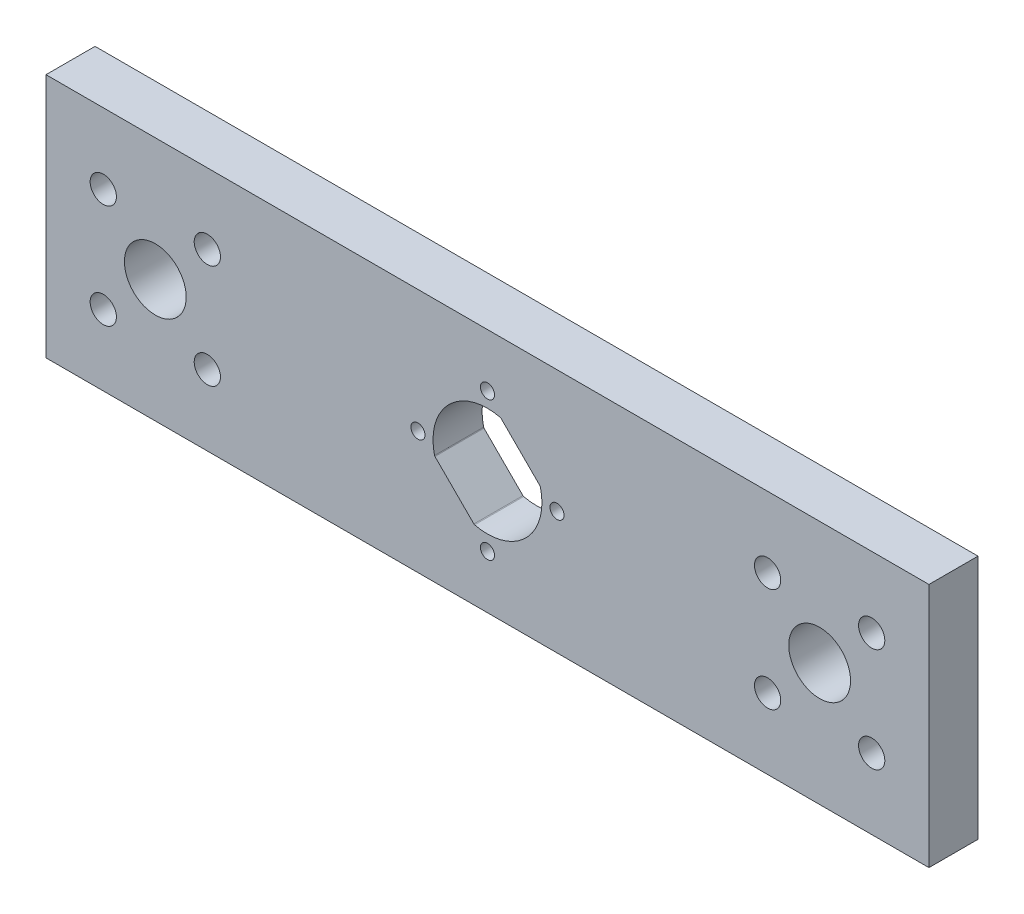
ISO-10303-21;
HEADER;
FILE_DESCRIPTION(('STEP AP214'),'2;1');
FILE_NAME('part.step','',(''),(''),'','','');
FILE_SCHEMA(('AUTOMOTIVE_DESIGN { 1 0 10303 214 1 1 1 1 }'));
ENDSEC;
DATA;
#1=APPLICATION_CONTEXT('core data for automotive mechanical design processes');
#2=APPLICATION_PROTOCOL_DEFINITION('international standard','automotive_design',2000,#1);
#3=PRODUCT_CONTEXT('',#1,'mechanical');
#4=PRODUCT('Part','Part','',(#3));
#5=PRODUCT_RELATED_PRODUCT_CATEGORY('part','',(#4));
#6=PRODUCT_DEFINITION_FORMATION('','',#4);
#7=PRODUCT_DEFINITION_CONTEXT('part definition',#1,'design');
#8=PRODUCT_DEFINITION('design','',#6,#7);
#9=PRODUCT_DEFINITION_SHAPE('','',#8);
#10=(LENGTH_UNIT() NAMED_UNIT(*) SI_UNIT(.MILLI.,.METRE.));
#11=(NAMED_UNIT(*) PLANE_ANGLE_UNIT() SI_UNIT($,.RADIAN.));
#12=(NAMED_UNIT(*) SI_UNIT($,.STERADIAN.) SOLID_ANGLE_UNIT());
#13=UNCERTAINTY_MEASURE_WITH_UNIT(LENGTH_MEASURE(1.E-05),#10,'distance_accuracy_value','');
#14=(GEOMETRIC_REPRESENTATION_CONTEXT(3) GLOBAL_UNCERTAINTY_ASSIGNED_CONTEXT((#13)) GLOBAL_UNIT_ASSIGNED_CONTEXT((#10,
#11,#12)) REPRESENTATION_CONTEXT('',''));
#15=CARTESIAN_POINT('',(0.,0.,0.));
#16=DIRECTION('',(0.,0.,1.));
#17=DIRECTION('',(1.,0.,0.));
#18=AXIS2_PLACEMENT_3D('',#15,#16,#17);
#19=CARTESIAN_POINT('',(0.,0.,6.35));
#20=DIRECTION('',(0.,0.,1.));
#21=DIRECTION('',(1.,0.,0.));
#22=AXIS2_PLACEMENT_3D('',#19,#20,#21);
#23=PLANE('',#22);
#24=CARTESIAN_POINT('',(36.2648080151982,6.73519209080189,6.35));
#25=DIRECTION('',(0.,0.,1.));
#26=DIRECTION('',(-1.,0.,0.));
#27=AXIS2_PLACEMENT_3D('',#24,#25,#26);
#28=CIRCLE('',#27,1.7);
#29=CARTESIAN_POINT('',(34.5648080151982,6.73519209080189,6.35));
#30=VERTEX_POINT('',#29);
#31=EDGE_CURVE('E393',#30,#30,#28,.T.);
#32=ORIENTED_EDGE('',*,*,#31,.F.);
#33=EDGE_LOOP('',(#32));
#34=FACE_BOUND('',#33,.T.);
#35=CARTESIAN_POINT('',(49.7351921968018,-6.73519209080188,6.35));
#36=DIRECTION('',(0.,0.,1.));
#37=DIRECTION('',(-1.,0.,0.));
#38=AXIS2_PLACEMENT_3D('',#35,#36,#37);
#39=CIRCLE('',#38,1.7);
#40=CARTESIAN_POINT('',(48.0351921968018,-6.73519209080188,6.35));
#41=VERTEX_POINT('',#40);
#42=EDGE_CURVE('E405',#41,#41,#39,.T.);
#43=ORIENTED_EDGE('',*,*,#42,.F.);
#44=EDGE_LOOP('',(#43));
#45=FACE_BOUND('',#44,.T.);
#46=CARTESIAN_POINT('',(9.00000013410969,-7.63278329429795E-13,6.35));
#47=DIRECTION('',(0.,0.,1.));
#48=DIRECTION('',(1.,0.,0.));
#49=AXIS2_PLACEMENT_3D('',#46,#47,#48);
#50=CIRCLE('',#49,0.911500000000001);
#51=CARTESIAN_POINT('',(9.9115001341097,-7.63278329429795E-13,6.35));
#52=VERTEX_POINT('',#51);
#53=EDGE_CURVE('E417',#52,#52,#50,.T.);
#54=ORIENTED_EDGE('',*,*,#53,.F.);
#55=EDGE_LOOP('',(#54));
#56=FACE_BOUND('',#55,.T.);
#57=CARTESIAN_POINT('',(-9.0000001341112,-7.63278329429795E-13,6.35));
#58=DIRECTION('',(0.,0.,1.));
#59=DIRECTION('',(1.,0.,0.));
#60=AXIS2_PLACEMENT_3D('',#57,#58,#59);
#61=CIRCLE('',#60,0.911499999999999);
#62=CARTESIAN_POINT('',(-8.08850013411121,-7.63278329429795E-13,6.35));
#63=VERTEX_POINT('',#62);
#64=EDGE_CURVE('E429',#63,#63,#61,.T.);
#65=ORIENTED_EDGE('',*,*,#64,.F.);
#66=EDGE_LOOP('',(#65));
#67=FACE_BOUND('',#66,.T.);
#68=CARTESIAN_POINT('',(-36.2648080151982,-6.7351920908019,6.35));
#69=DIRECTION('',(0.,0.,1.));
#70=DIRECTION('',(-1.,0.,0.));
#71=AXIS2_PLACEMENT_3D('',#68,#69,#70);
#72=CIRCLE('',#71,1.7);
#73=CARTESIAN_POINT('',(-37.9648080151982,-6.7351920908019,6.35));
#74=VERTEX_POINT('',#73);
#75=EDGE_CURVE('E167',#74,#74,#72,.T.);
#76=ORIENTED_EDGE('',*,*,#75,.F.);
#77=EDGE_LOOP('',(#76));
#78=FACE_BOUND('',#77,.T.);
#79=CARTESIAN_POINT('',(-36.2648080151982,6.7351920908019,6.35));
#80=DIRECTION('',(0.,0.,1.));
#81=DIRECTION('',(1.,0.,0.));
#82=AXIS2_PLACEMENT_3D('',#79,#80,#81);
#83=CIRCLE('',#82,1.7);
#84=CARTESIAN_POINT('',(-34.5648080151982,6.7351920908019,6.35));
#85=VERTEX_POINT('',#84);
#86=EDGE_CURVE('E203',#85,#85,#83,.T.);
#87=ORIENTED_EDGE('',*,*,#86,.F.);
#88=EDGE_LOOP('',(#87));
#89=FACE_BOUND('',#88,.T.);
#90=CARTESIAN_POINT('',(-43.000000106,0.,6.35));
#91=DIRECTION('',(0.,0.,1.));
#92=DIRECTION('',(1.,0.,0.));
#93=AXIS2_PLACEMENT_3D('',#90,#91,#92);
#94=CIRCLE('',#93,4.00000000000001);
#95=CARTESIAN_POINT('',(-39.000000106,0.,6.35));
#96=VERTEX_POINT('',#95);
#97=EDGE_CURVE('E215',#96,#96,#94,.T.);
#98=ORIENTED_EDGE('',*,*,#97,.F.);
#99=EDGE_LOOP('',(#98));
#100=FACE_BOUND('',#99,.T.);
#101=DIRECTION('',(0.,1.,0.));
#102=VECTOR('',#101,1.);
#103=CARTESIAN_POINT('',(57.15,15.875,6.35));
#104=LINE('',#103,#102);
#105=CARTESIAN_POINT('',(57.15,-15.875,6.35));
#106=VERTEX_POINT('',#105);
#107=CARTESIAN_POINT('',(57.15,15.875,6.35));
#108=VERTEX_POINT('',#107);
#109=EDGE_CURVE('E221',#106,#108,#104,.T.);
#110=ORIENTED_EDGE('',*,*,#109,.T.);
#111=DIRECTION('',(-1.,0.,0.));
#112=VECTOR('',#111,1.);
#113=CARTESIAN_POINT('',(-57.15,15.875,6.35));
#114=LINE('',#113,#112);
#115=CARTESIAN_POINT('',(-57.15,15.875,6.35));
#116=VERTEX_POINT('',#115);
#117=EDGE_CURVE('E224',#108,#116,#114,.T.);
#118=ORIENTED_EDGE('',*,*,#117,.T.);
#119=DIRECTION('',(0.,-1.,0.));
#120=VECTOR('',#119,1.);
#121=CARTESIAN_POINT('',(-57.15,15.875,6.35));
#122=LINE('',#121,#120);
#123=CARTESIAN_POINT('',(-57.15,-15.875,6.35));
#124=VERTEX_POINT('',#123);
#125=EDGE_CURVE('E227',#116,#124,#122,.T.);
#126=ORIENTED_EDGE('',*,*,#125,.T.);
#127=DIRECTION('',(1.,0.,0.));
#128=VECTOR('',#127,1.);
#129=CARTESIAN_POINT('',(-57.15,-15.875,6.35));
#130=LINE('',#129,#128);
#131=EDGE_CURVE('E229',#124,#106,#130,.T.);
#132=ORIENTED_EDGE('',*,*,#131,.T.);
#133=EDGE_LOOP('',(#110,#118,#126,#132));
#134=FACE_BOUND('',#133,.T.);
#135=CARTESIAN_POINT('',(43.000000106,0.,6.35));
#136=DIRECTION('',(0.,0.,1.));
#137=DIRECTION('',(1.,0.,0.));
#138=AXIS2_PLACEMENT_3D('',#135,#136,#137);
#139=CIRCLE('',#138,4.);
#140=CARTESIAN_POINT('',(47.000000106,0.,6.35));
#141=VERTEX_POINT('',#140);
#142=EDGE_CURVE('E209',#141,#141,#139,.T.);
#143=ORIENTED_EDGE('',*,*,#142,.F.);
#144=EDGE_LOOP('',(#143));
#145=FACE_BOUND('',#144,.T.);
#146=CARTESIAN_POINT('',(-49.7351921968018,6.73519209080188,6.35));
#147=DIRECTION('',(0.,0.,1.));
#148=DIRECTION('',(-1.,0.,0.));
#149=AXIS2_PLACEMENT_3D('',#146,#147,#148);
#150=CIRCLE('',#149,1.7);
#151=CARTESIAN_POINT('',(-51.4351921968018,6.73519209080188,6.35));
#152=VERTEX_POINT('',#151);
#153=EDGE_CURVE('E197',#152,#152,#150,.T.);
#154=ORIENTED_EDGE('',*,*,#153,.F.);
#155=EDGE_LOOP('',(#154));
#156=FACE_BOUND('',#155,.T.);
#157=CARTESIAN_POINT('',(-7.52869988573934E-13,-7.63278329429795E-13,6.35));
#158=DIRECTION('',(0.,0.,1.));
#159=DIRECTION('',(1.,0.,0.));
#160=AXIS2_PLACEMENT_3D('',#157,#158,#159);
#161=CIRCLE('',#160,7.05);
#162=CARTESIAN_POINT('',(1.66385561397105,6.85084553145406,6.35));
#163=VERTEX_POINT('',#162);
#164=CARTESIAN_POINT('',(-6.85084553145558,-1.66385561397257,6.35));
#165=VERTEX_POINT('',#164);
#166=EDGE_CURVE('E137',#163,#165,#161,.T.);
#167=ORIENTED_EDGE('',*,*,#166,.F.);
#168=CARTESIAN_POINT('',(1.61665403626972,6.65649530361136,6.35));
#169=DIRECTION('',(0.,0.,1.));
#170=DIRECTION('',(1.,0.,0.));
#171=AXIS2_PLACEMENT_3D('',#168,#169,#170);
#172=CIRCLE('',#171,0.200000000000001);
#173=CARTESIAN_POINT('',(1.75807539250702,6.79791665984868,6.35));
#174=VERTEX_POINT('',#173);
#175=EDGE_CURVE('E129',#174,#163,#172,.T.);
#176=ORIENTED_EDGE('',*,*,#175,.F.);
#177=DIRECTION('',(-0.707106781186547,0.707106781186547,0.));
#178=VECTOR('',#177,1.);
#179=CARTESIAN_POINT('',(6.79791665984869,1.75807539250701,6.35));
#180=LINE('',#179,#178);
#181=CARTESIAN_POINT('',(6.79791665984868,1.75807539250701,6.35));
#182=VERTEX_POINT('',#181);
#183=EDGE_CURVE('E164',#182,#174,#180,.T.);
#184=ORIENTED_EDGE('',*,*,#183,.F.);
#185=CARTESIAN_POINT('',(6.65649530361138,1.6166540362697,6.35));
#186=DIRECTION('',(0.,0.,1.));
#187=DIRECTION('',(1.,0.,0.));
#188=AXIS2_PLACEMENT_3D('',#185,#186,#187);
#189=CIRCLE('',#188,0.200000000000004);
#190=CARTESIAN_POINT('',(6.85084553145407,1.66385561397104,6.35));
#191=VERTEX_POINT('',#190);
#192=EDGE_CURVE('E162',#191,#182,#189,.T.);
#193=ORIENTED_EDGE('',*,*,#192,.F.);
#194=CARTESIAN_POINT('',(-7.52869988573934E-13,-7.63278329429795E-13,6.35));
#195=DIRECTION('',(0.,0.,1.));
#196=DIRECTION('',(1.,0.,0.));
#197=AXIS2_PLACEMENT_3D('',#194,#195,#196);
#198=CIRCLE('',#197,7.05);
#199=CARTESIAN_POINT('',(-1.66385561397255,-6.85084553145559,6.35));
#200=VERTEX_POINT('',#199);
#201=EDGE_CURVE('E160',#200,#191,#198,.T.);
#202=ORIENTED_EDGE('',*,*,#201,.F.);
#203=CARTESIAN_POINT('',(-1.61665403627122,-6.65649530361289,6.35));
#204=DIRECTION('',(0.,0.,1.));
#205=DIRECTION('',(1.,0.,0.));
#206=AXIS2_PLACEMENT_3D('',#203,#204,#205);
#207=CIRCLE('',#206,0.200000000000011);
#208=CARTESIAN_POINT('',(-1.75807539250853,-6.79791665985022,6.35));
#209=VERTEX_POINT('',#208);
#210=EDGE_CURVE('E158',#209,#200,#207,.T.);
#211=ORIENTED_EDGE('',*,*,#210,.F.);
#212=DIRECTION('',(0.707106781186548,-0.707106781186548,0.));
#213=VECTOR('',#212,1.);
#214=CARTESIAN_POINT('',(-6.7979166598502,-1.75807539250855,6.35));
#215=LINE('',#214,#213);
#216=CARTESIAN_POINT('',(-6.7979166598502,-1.75807539250855,6.35));
#217=VERTEX_POINT('',#216);
#218=EDGE_CURVE('E153',#217,#209,#215,.T.);
#219=ORIENTED_EDGE('',*,*,#218,.F.);
#220=CARTESIAN_POINT('',(-6.65649530361288,-1.61665403627124,6.35));
#221=DIRECTION('',(0.,0.,1.));
#222=DIRECTION('',(1.,0.,0.));
#223=AXIS2_PLACEMENT_3D('',#220,#221,#222);
#224=CIRCLE('',#223,0.2);
#225=EDGE_CURVE('E151',#165,#217,#224,.T.);
#226=ORIENTED_EDGE('',*,*,#225,.F.);
#227=EDGE_LOOP('',(#167,#176,#184,#193,#202,#211,#219,#226));
#228=FACE_BOUND('',#227,.T.);
#229=CARTESIAN_POINT('',(-49.7351921968018,-6.73519209080188,6.35));
#230=DIRECTION('',(0.,0.,1.));
#231=DIRECTION('',(1.,0.,0.));
#232=AXIS2_PLACEMENT_3D('',#229,#230,#231);
#233=CIRCLE('',#232,1.7);
#234=CARTESIAN_POINT('',(-48.0351921968018,-6.73519209080188,6.35));
#235=VERTEX_POINT('',#234);
#236=EDGE_CURVE('E435',#235,#235,#233,.T.);
#237=ORIENTED_EDGE('',*,*,#236,.F.);
#238=EDGE_LOOP('',(#237));
#239=FACE_BOUND('',#238,.T.);
#240=CARTESIAN_POINT('',(-7.50665624302622E-13,-9.00000013411121,6.35));
#241=DIRECTION('',(0.,0.,1.));
#242=DIRECTION('',(1.,0.,0.));
#243=AXIS2_PLACEMENT_3D('',#240,#241,#242);
#244=CIRCLE('',#243,0.911499999999998);
#245=CARTESIAN_POINT('',(0.911499999999248,-9.00000013411121,6.35));
#246=VERTEX_POINT('',#245);
#247=EDGE_CURVE('E423',#246,#246,#244,.T.);
#248=ORIENTED_EDGE('',*,*,#247,.F.);
#249=EDGE_LOOP('',(#248));
#250=FACE_BOUND('',#249,.T.);
#251=CARTESIAN_POINT('',(-7.52869988573934E-13,9.00000013410969,6.35));
#252=DIRECTION('',(0.,0.,1.));
#253=DIRECTION('',(1.,0.,0.));
#254=AXIS2_PLACEMENT_3D('',#251,#252,#253);
#255=CIRCLE('',#254,0.911499999999998);
#256=CARTESIAN_POINT('',(0.911499999999245,9.00000013410969,6.35));
#257=VERTEX_POINT('',#256);
#258=EDGE_CURVE('E411',#257,#257,#255,.T.);
#259=ORIENTED_EDGE('',*,*,#258,.F.);
#260=EDGE_LOOP('',(#259));
#261=FACE_BOUND('',#260,.T.);
#262=CARTESIAN_POINT('',(36.2648080151982,-6.73519209080189,6.35));
#263=DIRECTION('',(0.,0.,1.));
#264=DIRECTION('',(1.,0.,0.));
#265=AXIS2_PLACEMENT_3D('',#262,#263,#264);
#266=CIRCLE('',#265,1.7);
#267=CARTESIAN_POINT('',(37.9648080151982,-6.73519209080189,6.35));
#268=VERTEX_POINT('',#267);
#269=EDGE_CURVE('E399',#268,#268,#266,.T.);
#270=ORIENTED_EDGE('',*,*,#269,.F.);
#271=EDGE_LOOP('',(#270));
#272=FACE_BOUND('',#271,.T.);
#273=CARTESIAN_POINT('',(49.7351921968018,6.73519209080189,6.35));
#274=DIRECTION('',(0.,0.,1.));
#275=DIRECTION('',(1.,0.,0.));
#276=AXIS2_PLACEMENT_3D('',#273,#274,#275);
#277=CIRCLE('',#276,1.7);
#278=CARTESIAN_POINT('',(51.4351921968018,6.73519209080189,6.35));
#279=VERTEX_POINT('',#278);
#280=EDGE_CURVE('E384',#279,#279,#277,.T.);
#281=ORIENTED_EDGE('',*,*,#280,.F.);
#282=EDGE_LOOP('',(#281));
#283=FACE_BOUND('',#282,.T.);
#284=ADVANCED_FACE('F40',(#34,#45,#56,#67,#78,#89,#100,#134,#145,#156,#228,#239,#250,#261,#272,
#283),#23,.T.);
#285=CARTESIAN_POINT('',(0.,0.,0.));
#286=DIRECTION('',(0.,0.,1.));
#287=DIRECTION('',(1.,0.,0.));
#288=AXIS2_PLACEMENT_3D('',#285,#286,#287);
#289=PLANE('',#288);
#290=CARTESIAN_POINT('',(-49.7351921968018,6.73519209080188,0.));
#291=DIRECTION('',(0.,0.,1.));
#292=DIRECTION('',(-1.,0.,0.));
#293=AXIS2_PLACEMENT_3D('',#290,#291,#292);
#294=CIRCLE('',#293,1.7);
#295=CARTESIAN_POINT('',(-51.4351921968018,6.73519209080188,0.));
#296=VERTEX_POINT('',#295);
#297=EDGE_CURVE('E145',#296,#296,#294,.T.);
#298=ORIENTED_EDGE('',*,*,#297,.T.);
#299=EDGE_LOOP('',(#298));
#300=FACE_BOUND('',#299,.T.);
#301=CARTESIAN_POINT('',(-36.2648080151982,6.7351920908019,0.));
#302=DIRECTION('',(0.,0.,1.));
#303=DIRECTION('',(1.,0.,0.));
#304=AXIS2_PLACEMENT_3D('',#301,#302,#303);
#305=CIRCLE('',#304,1.7);
#306=CARTESIAN_POINT('',(-34.5648080151982,6.7351920908019,0.));
#307=VERTEX_POINT('',#306);
#308=EDGE_CURVE('E200',#307,#307,#305,.T.);
#309=ORIENTED_EDGE('',*,*,#308,.T.);
#310=EDGE_LOOP('',(#309));
#311=FACE_BOUND('',#310,.T.);
#312=CARTESIAN_POINT('',(43.000000106,0.,0.));
#313=DIRECTION('',(0.,0.,1.));
#314=DIRECTION('',(1.,0.,0.));
#315=AXIS2_PLACEMENT_3D('',#312,#313,#314);
#316=CIRCLE('',#315,4.);
#317=CARTESIAN_POINT('',(47.000000106,0.,0.));
#318=VERTEX_POINT('',#317);
#319=EDGE_CURVE('E206',#318,#318,#316,.T.);
#320=ORIENTED_EDGE('',*,*,#319,.T.);
#321=EDGE_LOOP('',(#320));
#322=FACE_BOUND('',#321,.T.);
#323=CARTESIAN_POINT('',(-43.000000106,0.,0.));
#324=DIRECTION('',(0.,0.,1.));
#325=DIRECTION('',(1.,0.,0.));
#326=AXIS2_PLACEMENT_3D('',#323,#324,#325);
#327=CIRCLE('',#326,4.00000000000001);
#328=CARTESIAN_POINT('',(-39.000000106,0.,0.));
#329=VERTEX_POINT('',#328);
#330=EDGE_CURVE('E212',#329,#329,#327,.T.);
#331=ORIENTED_EDGE('',*,*,#330,.T.);
#332=EDGE_LOOP('',(#331));
#333=FACE_BOUND('',#332,.T.);
#334=DIRECTION('',(0.,1.,0.));
#335=VECTOR('',#334,1.);
#336=CARTESIAN_POINT('',(57.15,15.875,0.));
#337=LINE('',#336,#335);
#338=CARTESIAN_POINT('',(57.15,-15.875,0.));
#339=VERTEX_POINT('',#338);
#340=CARTESIAN_POINT('',(57.15,15.875,0.));
#341=VERTEX_POINT('',#340);
#342=EDGE_CURVE('E218',#339,#341,#337,.T.);
#343=ORIENTED_EDGE('',*,*,#342,.F.);
#344=DIRECTION('',(1.,0.,0.));
#345=VECTOR('',#344,1.);
#346=CARTESIAN_POINT('',(-57.15,-15.875,0.));
#347=LINE('',#346,#345);
#348=CARTESIAN_POINT('',(-57.15,-15.875,0.));
#349=VERTEX_POINT('',#348);
#350=EDGE_CURVE('E225',#349,#339,#347,.T.);
#351=ORIENTED_EDGE('',*,*,#350,.F.);
#352=DIRECTION('',(0.,-1.,0.));
#353=VECTOR('',#352,1.);
#354=CARTESIAN_POINT('',(-57.15,15.875,0.));
#355=LINE('',#354,#353);
#356=CARTESIAN_POINT('',(-57.15,15.875,0.));
#357=VERTEX_POINT('',#356);
#358=EDGE_CURVE('E236',#357,#349,#355,.T.);
#359=ORIENTED_EDGE('',*,*,#358,.F.);
#360=DIRECTION('',(-1.,0.,0.));
#361=VECTOR('',#360,1.);
#362=CARTESIAN_POINT('',(-57.15,15.875,0.));
#363=LINE('',#362,#361);
#364=EDGE_CURVE('E234',#341,#357,#363,.T.);
#365=ORIENTED_EDGE('',*,*,#364,.F.);
#366=EDGE_LOOP('',(#343,#351,#359,#365));
#367=FACE_BOUND('',#366,.T.);
#368=CARTESIAN_POINT('',(1.61665403626972,6.65649530361136,0.));
#369=DIRECTION('',(0.,0.,1.));
#370=DIRECTION('',(1.,0.,0.));
#371=AXIS2_PLACEMENT_3D('',#368,#369,#370);
#372=CIRCLE('',#371,0.200000000000001);
#373=CARTESIAN_POINT('',(1.75807539250702,6.79791665984868,0.));
#374=VERTEX_POINT('',#373);
#375=CARTESIAN_POINT('',(1.66385561397105,6.85084553145406,0.));
#376=VERTEX_POINT('',#375);
#377=EDGE_CURVE('E63',#374,#376,#372,.T.);
#378=ORIENTED_EDGE('',*,*,#377,.T.);
#379=CARTESIAN_POINT('',(-7.52869988573934E-13,-7.63278329429795E-13,0.));
#380=DIRECTION('',(0.,0.,1.));
#381=DIRECTION('',(1.,0.,0.));
#382=AXIS2_PLACEMENT_3D('',#379,#380,#381);
#383=CIRCLE('',#382,7.05);
#384=CARTESIAN_POINT('',(-6.85084553145558,-1.66385561397257,0.));
#385=VERTEX_POINT('',#384);
#386=EDGE_CURVE('E144',#376,#385,#383,.T.);
#387=ORIENTED_EDGE('',*,*,#386,.T.);
#388=CARTESIAN_POINT('',(-6.65649530361288,-1.61665403627124,0.));
#389=DIRECTION('',(0.,0.,1.));
#390=DIRECTION('',(1.,0.,0.));
#391=AXIS2_PLACEMENT_3D('',#388,#389,#390);
#392=CIRCLE('',#391,0.2);
#393=CARTESIAN_POINT('',(-6.7979166598502,-1.75807539250855,0.));
#394=VERTEX_POINT('',#393);
#395=EDGE_CURVE('E169',#385,#394,#392,.T.);
#396=ORIENTED_EDGE('',*,*,#395,.T.);
#397=DIRECTION('',(0.707106781186548,-0.707106781186548,0.));
#398=VECTOR('',#397,1.);
#399=CARTESIAN_POINT('',(-6.7979166598502,-1.75807539250855,0.));
#400=LINE('',#399,#398);
#401=CARTESIAN_POINT('',(-1.75807539250853,-6.79791665985022,0.));
#402=VERTEX_POINT('',#401);
#403=EDGE_CURVE('E172',#394,#402,#400,.T.);
#404=ORIENTED_EDGE('',*,*,#403,.T.);
#405=CARTESIAN_POINT('',(-1.61665403627122,-6.65649530361289,0.));
#406=DIRECTION('',(0.,0.,1.));
#407=DIRECTION('',(1.,0.,0.));
#408=AXIS2_PLACEMENT_3D('',#405,#406,#407);
#409=CIRCLE('',#408,0.200000000000011);
#410=CARTESIAN_POINT('',(-1.66385561397255,-6.85084553145559,0.));
#411=VERTEX_POINT('',#410);
#412=EDGE_CURVE('E175',#402,#411,#409,.T.);
#413=ORIENTED_EDGE('',*,*,#412,.T.);
#414=CARTESIAN_POINT('',(-7.52869988573934E-13,-7.63278329429795E-13,0.));
#415=DIRECTION('',(0.,0.,1.));
#416=DIRECTION('',(1.,0.,0.));
#417=AXIS2_PLACEMENT_3D('',#414,#415,#416);
#418=CIRCLE('',#417,7.05);
#419=CARTESIAN_POINT('',(6.85084553145407,1.66385561397104,0.));
#420=VERTEX_POINT('',#419);
#421=EDGE_CURVE('E178',#411,#420,#418,.T.);
#422=ORIENTED_EDGE('',*,*,#421,.T.);
#423=CARTESIAN_POINT('',(6.65649530361138,1.6166540362697,0.));
#424=DIRECTION('',(0.,0.,1.));
#425=DIRECTION('',(1.,0.,0.));
#426=AXIS2_PLACEMENT_3D('',#423,#424,#425);
#427=CIRCLE('',#426,0.200000000000004);
#428=CARTESIAN_POINT('',(6.79791665984869,1.75807539250701,0.));
#429=VERTEX_POINT('',#428);
#430=EDGE_CURVE('E181',#420,#429,#427,.T.);
#431=ORIENTED_EDGE('',*,*,#430,.T.);
#432=DIRECTION('',(-0.707106781186547,0.707106781186547,0.));
#433=VECTOR('',#432,1.);
#434=CARTESIAN_POINT('',(6.79791665984869,1.75807539250701,0.));
#435=LINE('',#434,#433);
#436=EDGE_CURVE('E138',#429,#374,#435,.T.);
#437=ORIENTED_EDGE('',*,*,#436,.T.);
#438=EDGE_LOOP('',(#378,#387,#396,#404,#413,#422,#431,#437));
#439=FACE_BOUND('',#438,.T.);
#440=CARTESIAN_POINT('',(-36.2648080151982,-6.7351920908019,0.));
#441=DIRECTION('',(0.,0.,1.));
#442=DIRECTION('',(-1.,0.,0.));
#443=AXIS2_PLACEMENT_3D('',#440,#441,#442);
#444=CIRCLE('',#443,1.7);
#445=CARTESIAN_POINT('',(-37.9648080151982,-6.7351920908019,0.));
#446=VERTEX_POINT('',#445);
#447=EDGE_CURVE('E438',#446,#446,#444,.T.);
#448=ORIENTED_EDGE('',*,*,#447,.T.);
#449=EDGE_LOOP('',(#448));
#450=FACE_BOUND('',#449,.T.);
#451=CARTESIAN_POINT('',(-49.7351921968018,-6.73519209080188,0.));
#452=DIRECTION('',(0.,0.,1.));
#453=DIRECTION('',(1.,0.,0.));
#454=AXIS2_PLACEMENT_3D('',#451,#452,#453);
#455=CIRCLE('',#454,1.7);
#456=CARTESIAN_POINT('',(-48.0351921968018,-6.73519209080188,0.));
#457=VERTEX_POINT('',#456);
#458=EDGE_CURVE('E432',#457,#457,#455,.T.);
#459=ORIENTED_EDGE('',*,*,#458,.T.);
#460=EDGE_LOOP('',(#459));
#461=FACE_BOUND('',#460,.T.);
#462=CARTESIAN_POINT('',(-9.0000001341112,-7.63278329429795E-13,0.));
#463=DIRECTION('',(0.,0.,1.));
#464=DIRECTION('',(1.,0.,0.));
#465=AXIS2_PLACEMENT_3D('',#462,#463,#464);
#466=CIRCLE('',#465,0.911499999999999);
#467=CARTESIAN_POINT('',(-8.08850013411121,-7.63278329429795E-13,0.));
#468=VERTEX_POINT('',#467);
#469=EDGE_CURVE('E426',#468,#468,#466,.T.);
#470=ORIENTED_EDGE('',*,*,#469,.T.);
#471=EDGE_LOOP('',(#470));
#472=FACE_BOUND('',#471,.T.);
#473=CARTESIAN_POINT('',(-7.50665624302622E-13,-9.00000013411121,0.));
#474=DIRECTION('',(0.,0.,1.));
#475=DIRECTION('',(1.,0.,0.));
#476=AXIS2_PLACEMENT_3D('',#473,#474,#475);
#477=CIRCLE('',#476,0.911499999999998);
#478=CARTESIAN_POINT('',(0.911499999999248,-9.00000013411121,0.));
#479=VERTEX_POINT('',#478);
#480=EDGE_CURVE('E420',#479,#479,#477,.T.);
#481=ORIENTED_EDGE('',*,*,#480,.T.);
#482=EDGE_LOOP('',(#481));
#483=FACE_BOUND('',#482,.T.);
#484=CARTESIAN_POINT('',(9.00000013410969,-7.63278329429795E-13,0.));
#485=DIRECTION('',(0.,0.,1.));
#486=DIRECTION('',(1.,0.,0.));
#487=AXIS2_PLACEMENT_3D('',#484,#485,#486);
#488=CIRCLE('',#487,0.911500000000001);
#489=CARTESIAN_POINT('',(9.9115001341097,-7.63278329429795E-13,0.));
#490=VERTEX_POINT('',#489);
#491=EDGE_CURVE('E414',#490,#490,#488,.T.);
#492=ORIENTED_EDGE('',*,*,#491,.T.);
#493=EDGE_LOOP('',(#492));
#494=FACE_BOUND('',#493,.T.);
#495=CARTESIAN_POINT('',(-7.52869988573934E-13,9.00000013410969,0.));
#496=DIRECTION('',(0.,0.,1.));
#497=DIRECTION('',(1.,0.,0.));
#498=AXIS2_PLACEMENT_3D('',#495,#496,#497);
#499=CIRCLE('',#498,0.911499999999998);
#500=CARTESIAN_POINT('',(0.911499999999245,9.00000013410969,0.));
#501=VERTEX_POINT('',#500);
#502=EDGE_CURVE('E408',#501,#501,#499,.T.);
#503=ORIENTED_EDGE('',*,*,#502,.T.);
#504=EDGE_LOOP('',(#503));
#505=FACE_BOUND('',#504,.T.);
#506=CARTESIAN_POINT('',(49.7351921968018,-6.73519209080188,0.));
#507=DIRECTION('',(0.,0.,1.));
#508=DIRECTION('',(-1.,0.,0.));
#509=AXIS2_PLACEMENT_3D('',#506,#507,#508);
#510=CIRCLE('',#509,1.7);
#511=CARTESIAN_POINT('',(48.0351921968018,-6.73519209080188,0.));
#512=VERTEX_POINT('',#511);
#513=EDGE_CURVE('E402',#512,#512,#510,.T.);
#514=ORIENTED_EDGE('',*,*,#513,.T.);
#515=EDGE_LOOP('',(#514));
#516=FACE_BOUND('',#515,.T.);
#517=CARTESIAN_POINT('',(36.2648080151982,-6.73519209080189,0.));
#518=DIRECTION('',(0.,0.,1.));
#519=DIRECTION('',(1.,0.,0.));
#520=AXIS2_PLACEMENT_3D('',#517,#518,#519);
#521=CIRCLE('',#520,1.7);
#522=CARTESIAN_POINT('',(37.9648080151982,-6.73519209080189,0.));
#523=VERTEX_POINT('',#522);
#524=EDGE_CURVE('E396',#523,#523,#521,.T.);
#525=ORIENTED_EDGE('',*,*,#524,.T.);
#526=EDGE_LOOP('',(#525));
#527=FACE_BOUND('',#526,.T.);
#528=CARTESIAN_POINT('',(36.2648080151982,6.73519209080189,0.));
#529=DIRECTION('',(0.,0.,1.));
#530=DIRECTION('',(-1.,0.,0.));
#531=AXIS2_PLACEMENT_3D('',#528,#529,#530);
#532=CIRCLE('',#531,1.7);
#533=CARTESIAN_POINT('',(34.5648080151982,6.73519209080189,0.));
#534=VERTEX_POINT('',#533);
#535=EDGE_CURVE('E390',#534,#534,#532,.T.);
#536=ORIENTED_EDGE('',*,*,#535,.T.);
#537=EDGE_LOOP('',(#536));
#538=FACE_BOUND('',#537,.T.);
#539=CARTESIAN_POINT('',(49.7351921968018,6.73519209080189,0.));
#540=DIRECTION('',(0.,0.,1.));
#541=DIRECTION('',(1.,0.,0.));
#542=AXIS2_PLACEMENT_3D('',#539,#540,#541);
#543=CIRCLE('',#542,1.7);
#544=CARTESIAN_POINT('',(51.4351921968018,6.73519209080189,0.));
#545=VERTEX_POINT('',#544);
#546=EDGE_CURVE('E387',#545,#545,#543,.T.);
#547=ORIENTED_EDGE('',*,*,#546,.T.);
#548=EDGE_LOOP('',(#547));
#549=FACE_BOUND('',#548,.T.);
#550=ADVANCED_FACE('F254',(#300,#311,#322,#333,#367,#439,#450,#461,#472,#483,#494,#505,#516,
#527,#538,#549),#289,.F.);
#551=CARTESIAN_POINT('',(57.15,15.875,6.35));
#552=DIRECTION('',(-1.,0.,0.));
#553=DIRECTION('',(0.,0.,1.));
#554=AXIS2_PLACEMENT_3D('',#551,#552,#553);
#555=PLANE('',#554);
#556=ORIENTED_EDGE('',*,*,#342,.T.);
#557=DIRECTION('',(0.,0.,-1.));
#558=VECTOR('',#557,1.);
#559=CARTESIAN_POINT('',(57.15,15.875,6.35));
#560=LINE('',#559,#558);
#561=EDGE_CURVE('E11',#108,#341,#560,.T.);
#562=ORIENTED_EDGE('',*,*,#561,.F.);
#563=ORIENTED_EDGE('',*,*,#109,.F.);
#564=DIRECTION('',(0.,0.,-1.));
#565=VECTOR('',#564,1.);
#566=CARTESIAN_POINT('',(57.15,-15.875,6.35));
#567=LINE('',#566,#565);
#568=EDGE_CURVE('E231',#106,#339,#567,.T.);
#569=ORIENTED_EDGE('',*,*,#568,.T.);
#570=EDGE_LOOP('',(#556,#562,#563,#569));
#571=FACE_BOUND('',#570,.T.);
#572=ADVANCED_FACE('F42',(#571),#555,.F.);
#573=CARTESIAN_POINT('',(-57.15,15.875,6.35));
#574=DIRECTION('',(0.,-1.,0.));
#575=DIRECTION('',(0.,0.,-1.));
#576=AXIS2_PLACEMENT_3D('',#573,#574,#575);
#577=PLANE('',#576);
#578=ORIENTED_EDGE('',*,*,#364,.T.);
#579=DIRECTION('',(0.,0.,-1.));
#580=VECTOR('',#579,1.);
#581=CARTESIAN_POINT('',(-57.15,15.875,6.35));
#582=LINE('',#581,#580);
#583=EDGE_CURVE('E48',#116,#357,#582,.T.);
#584=ORIENTED_EDGE('',*,*,#583,.F.);
#585=ORIENTED_EDGE('',*,*,#117,.F.);
#586=ORIENTED_EDGE('',*,*,#561,.T.);
#587=EDGE_LOOP('',(#578,#584,#585,#586));
#588=FACE_BOUND('',#587,.T.);
#589=ADVANCED_FACE('F265',(#588),#577,.F.);
#590=CARTESIAN_POINT('',(-57.15,15.875,6.35));
#591=DIRECTION('',(1.,0.,0.));
#592=DIRECTION('',(0.,0.,-1.));
#593=AXIS2_PLACEMENT_3D('',#590,#591,#592);
#594=PLANE('',#593);
#595=ORIENTED_EDGE('',*,*,#358,.T.);
#596=DIRECTION('',(0.,0.,-1.));
#597=VECTOR('',#596,1.);
#598=CARTESIAN_POINT('',(-57.15,-15.875,6.35));
#599=LINE('',#598,#597);
#600=EDGE_CURVE('E241',#124,#349,#599,.T.);
#601=ORIENTED_EDGE('',*,*,#600,.F.);
#602=ORIENTED_EDGE('',*,*,#125,.F.);
#603=ORIENTED_EDGE('',*,*,#583,.T.);
#604=EDGE_LOOP('',(#595,#601,#602,#603));
#605=FACE_BOUND('',#604,.T.);
#606=ADVANCED_FACE('F248',(#605),#594,.F.);
#607=CARTESIAN_POINT('',(-57.15,-15.875,6.35));
#608=DIRECTION('',(0.,1.,0.));
#609=DIRECTION('',(0.,0.,1.));
#610=AXIS2_PLACEMENT_3D('',#607,#608,#609);
#611=PLANE('',#610);
#612=ORIENTED_EDGE('',*,*,#350,.T.);
#613=ORIENTED_EDGE('',*,*,#568,.F.);
#614=ORIENTED_EDGE('',*,*,#131,.F.);
#615=ORIENTED_EDGE('',*,*,#600,.T.);
#616=EDGE_LOOP('',(#612,#613,#614,#615));
#617=FACE_BOUND('',#616,.T.);
#618=ADVANCED_FACE('F258',(#617),#611,.F.);
#619=CARTESIAN_POINT('',(-43.000000106,0.,6.35));
#620=DIRECTION('',(0.,0.,-1.));
#621=DIRECTION('',(-1.,0.,0.));
#622=AXIS2_PLACEMENT_3D('',#619,#620,#621);
#623=CYLINDRICAL_SURFACE('',#622,4.00000000000001);
#624=ORIENTED_EDGE('',*,*,#97,.T.);
#625=EDGE_LOOP('',(#624));
#626=FACE_BOUND('',#625,.T.);
#627=ORIENTED_EDGE('',*,*,#330,.F.);
#628=EDGE_LOOP('',(#627));
#629=FACE_BOUND('',#628,.T.);
#630=ADVANCED_FACE('F283',(#626,#629),#623,.F.);
#631=CARTESIAN_POINT('',(43.000000106,0.,6.35));
#632=DIRECTION('',(0.,0.,-1.));
#633=DIRECTION('',(-1.,0.,0.));
#634=AXIS2_PLACEMENT_3D('',#631,#632,#633);
#635=CYLINDRICAL_SURFACE('',#634,4.);
#636=ORIENTED_EDGE('',*,*,#142,.T.);
#637=EDGE_LOOP('',(#636));
#638=FACE_BOUND('',#637,.T.);
#639=ORIENTED_EDGE('',*,*,#319,.F.);
#640=EDGE_LOOP('',(#639));
#641=FACE_BOUND('',#640,.T.);
#642=ADVANCED_FACE('F290',(#638,#641),#635,.F.);
#643=CARTESIAN_POINT('',(-36.2648080151982,6.7351920908019,6.35));
#644=DIRECTION('',(0.,0.,-1.));
#645=DIRECTION('',(-1.,0.,0.));
#646=AXIS2_PLACEMENT_3D('',#643,#644,#645);
#647=CYLINDRICAL_SURFACE('',#646,1.7);
#648=ORIENTED_EDGE('',*,*,#86,.T.);
#649=EDGE_LOOP('',(#648));
#650=FACE_BOUND('',#649,.T.);
#651=ORIENTED_EDGE('',*,*,#308,.F.);
#652=EDGE_LOOP('',(#651));
#653=FACE_BOUND('',#652,.T.);
#654=ADVANCED_FACE('F295',(#650,#653),#647,.F.);
#655=CARTESIAN_POINT('',(-49.7351921968018,6.73519209080188,6.35));
#656=DIRECTION('',(0.,0.,-1.));
#657=DIRECTION('',(-1.,0.,0.));
#658=AXIS2_PLACEMENT_3D('',#655,#656,#657);
#659=CYLINDRICAL_SURFACE('',#658,1.7);
#660=ORIENTED_EDGE('',*,*,#153,.T.);
#661=EDGE_LOOP('',(#660));
#662=FACE_BOUND('',#661,.T.);
#663=ORIENTED_EDGE('',*,*,#297,.F.);
#664=EDGE_LOOP('',(#663));
#665=FACE_BOUND('',#664,.T.);
#666=ADVANCED_FACE('F305',(#662,#665),#659,.F.);
#667=CARTESIAN_POINT('',(1.61665403626972,6.65649530361136,6.35));
#668=DIRECTION('',(0.,0.,-1.));
#669=DIRECTION('',(-1.,0.,0.));
#670=AXIS2_PLACEMENT_3D('',#667,#668,#669);
#671=CYLINDRICAL_SURFACE('',#670,0.200000000000001);
#672=ORIENTED_EDGE('',*,*,#377,.F.);
#673=DIRECTION('',(0.,0.,-1.));
#674=VECTOR('',#673,1.);
#675=CARTESIAN_POINT('',(1.75807539250702,6.79791665984868,6.35));
#676=LINE('',#675,#674);
#677=EDGE_CURVE('E133',#174,#374,#676,.T.);
#678=ORIENTED_EDGE('',*,*,#677,.F.);
#679=ORIENTED_EDGE('',*,*,#175,.T.);
#680=DIRECTION('',(0.,0.,-1.));
#681=VECTOR('',#680,1.);
#682=CARTESIAN_POINT('',(1.66385561397105,6.85084553145406,6.35));
#683=LINE('',#682,#681);
#684=EDGE_CURVE('E132',#163,#376,#683,.T.);
#685=ORIENTED_EDGE('',*,*,#684,.T.);
#686=EDGE_LOOP('',(#672,#678,#679,#685));
#687=FACE_BOUND('',#686,.T.);
#688=ADVANCED_FACE('F131',(#687),#671,.F.);
#689=CARTESIAN_POINT('',(-7.52869988573934E-13,-7.63278329429795E-13,6.35));
#690=DIRECTION('',(0.,0.,-1.));
#691=DIRECTION('',(-1.,0.,0.));
#692=AXIS2_PLACEMENT_3D('',#689,#690,#691);
#693=CYLINDRICAL_SURFACE('',#692,7.05);
#694=ORIENTED_EDGE('',*,*,#386,.F.);
#695=ORIENTED_EDGE('',*,*,#684,.F.);
#696=ORIENTED_EDGE('',*,*,#166,.T.);
#697=DIRECTION('',(0.,0.,-1.));
#698=VECTOR('',#697,1.);
#699=CARTESIAN_POINT('',(-6.85084553145558,-1.66385561397257,6.35));
#700=LINE('',#699,#698);
#701=EDGE_CURVE('E146',#165,#385,#700,.T.);
#702=ORIENTED_EDGE('',*,*,#701,.T.);
#703=EDGE_LOOP('',(#694,#695,#696,#702));
#704=FACE_BOUND('',#703,.T.);
#705=ADVANCED_FACE('F141',(#704),#693,.F.);
#706=CARTESIAN_POINT('',(-6.65649530361288,-1.61665403627124,6.35));
#707=DIRECTION('',(0.,0.,-1.));
#708=DIRECTION('',(-1.,0.,0.));
#709=AXIS2_PLACEMENT_3D('',#706,#707,#708);
#710=CYLINDRICAL_SURFACE('',#709,0.2);
#711=ORIENTED_EDGE('',*,*,#395,.F.);
#712=ORIENTED_EDGE('',*,*,#701,.F.);
#713=ORIENTED_EDGE('',*,*,#225,.T.);
#714=DIRECTION('',(0.,0.,-1.));
#715=VECTOR('',#714,1.);
#716=CARTESIAN_POINT('',(-6.7979166598502,-1.75807539250855,6.35));
#717=LINE('',#716,#715);
#718=EDGE_CURVE('E194',#217,#394,#717,.T.);
#719=ORIENTED_EDGE('',*,*,#718,.T.);
#720=EDGE_LOOP('',(#711,#712,#713,#719));
#721=FACE_BOUND('',#720,.T.);
#722=ADVANCED_FACE('F317',(#721),#710,.F.);
#723=CARTESIAN_POINT('',(-6.7979166598502,-1.75807539250855,6.35));
#724=DIRECTION('',(0.707106781186548,0.707106781186548,0.));
#725=DIRECTION('',(-0.707106781186548,0.707106781186548,0.));
#726=AXIS2_PLACEMENT_3D('',#723,#724,#725);
#727=PLANE('',#726);
#728=ORIENTED_EDGE('',*,*,#403,.F.);
#729=ORIENTED_EDGE('',*,*,#718,.F.);
#730=ORIENTED_EDGE('',*,*,#218,.T.);
#731=DIRECTION('',(0.,0.,-1.));
#732=VECTOR('',#731,1.);
#733=CARTESIAN_POINT('',(-1.75807539250853,-6.79791665985022,6.35));
#734=LINE('',#733,#732);
#735=EDGE_CURVE('E192',#209,#402,#734,.T.);
#736=ORIENTED_EDGE('',*,*,#735,.T.);
#737=EDGE_LOOP('',(#728,#729,#730,#736));
#738=FACE_BOUND('',#737,.T.);
#739=ADVANCED_FACE('F320',(#738),#727,.T.);
#740=CARTESIAN_POINT('',(-1.61665403627122,-6.65649530361289,6.35));
#741=DIRECTION('',(0.,0.,-1.));
#742=DIRECTION('',(-1.,0.,0.));
#743=AXIS2_PLACEMENT_3D('',#740,#741,#742);
#744=CYLINDRICAL_SURFACE('',#743,0.200000000000011);
#745=ORIENTED_EDGE('',*,*,#412,.F.);
#746=ORIENTED_EDGE('',*,*,#735,.F.);
#747=ORIENTED_EDGE('',*,*,#210,.T.);
#748=DIRECTION('',(0.,0.,-1.));
#749=VECTOR('',#748,1.);
#750=CARTESIAN_POINT('',(-1.66385561397255,-6.85084553145559,6.35));
#751=LINE('',#750,#749);
#752=EDGE_CURVE('E190',#200,#411,#751,.T.);
#753=ORIENTED_EDGE('',*,*,#752,.T.);
#754=EDGE_LOOP('',(#745,#746,#747,#753));
#755=FACE_BOUND('',#754,.T.);
#756=ADVANCED_FACE('F324',(#755),#744,.F.);
#757=CARTESIAN_POINT('',(-7.52869988573934E-13,-7.63278329429795E-13,6.35));
#758=DIRECTION('',(0.,0.,-1.));
#759=DIRECTION('',(-1.,0.,0.));
#760=AXIS2_PLACEMENT_3D('',#757,#758,#759);
#761=CYLINDRICAL_SURFACE('',#760,7.05);
#762=ORIENTED_EDGE('',*,*,#421,.F.);
#763=ORIENTED_EDGE('',*,*,#752,.F.);
#764=ORIENTED_EDGE('',*,*,#201,.T.);
#765=DIRECTION('',(0.,0.,-1.));
#766=VECTOR('',#765,1.);
#767=CARTESIAN_POINT('',(6.85084553145407,1.66385561397104,6.35));
#768=LINE('',#767,#766);
#769=EDGE_CURVE('E188',#191,#420,#768,.T.);
#770=ORIENTED_EDGE('',*,*,#769,.T.);
#771=EDGE_LOOP('',(#762,#763,#764,#770));
#772=FACE_BOUND('',#771,.T.);
#773=ADVANCED_FACE('F328',(#772),#761,.F.);
#774=CARTESIAN_POINT('',(6.65649530361138,1.6166540362697,6.35));
#775=DIRECTION('',(0.,0.,-1.));
#776=DIRECTION('',(-1.,0.,0.));
#777=AXIS2_PLACEMENT_3D('',#774,#775,#776);
#778=CYLINDRICAL_SURFACE('',#777,0.200000000000004);
#779=ORIENTED_EDGE('',*,*,#430,.F.);
#780=ORIENTED_EDGE('',*,*,#769,.F.);
#781=ORIENTED_EDGE('',*,*,#192,.T.);
#782=DIRECTION('',(0.,0.,-1.));
#783=VECTOR('',#782,1.);
#784=CARTESIAN_POINT('',(6.79791665984869,1.75807539250701,6.35));
#785=LINE('',#784,#783);
#786=EDGE_CURVE('E55',#182,#429,#785,.T.);
#787=ORIENTED_EDGE('',*,*,#786,.T.);
#788=EDGE_LOOP('',(#779,#780,#781,#787));
#789=FACE_BOUND('',#788,.T.);
#790=ADVANCED_FACE('F332',(#789),#778,.F.);
#791=CARTESIAN_POINT('',(6.79791665984869,1.75807539250701,6.35));
#792=DIRECTION('',(-0.707106781186548,-0.707106781186548,0.));
#793=DIRECTION('',(0.707106781186548,-0.707106781186548,0.));
#794=AXIS2_PLACEMENT_3D('',#791,#792,#793);
#795=PLANE('',#794);
#796=ORIENTED_EDGE('',*,*,#436,.F.);
#797=ORIENTED_EDGE('',*,*,#786,.F.);
#798=ORIENTED_EDGE('',*,*,#183,.T.);
#799=ORIENTED_EDGE('',*,*,#677,.T.);
#800=EDGE_LOOP('',(#796,#797,#798,#799));
#801=FACE_BOUND('',#800,.T.);
#802=ADVANCED_FACE('F336',(#801),#795,.T.);
#803=CARTESIAN_POINT('',(-36.2648080151982,-6.7351920908019,6.35));
#804=DIRECTION('',(0.,0.,-1.));
#805=DIRECTION('',(-1.,0.,0.));
#806=AXIS2_PLACEMENT_3D('',#803,#804,#805);
#807=CYLINDRICAL_SURFACE('',#806,1.7);
#808=ORIENTED_EDGE('',*,*,#75,.T.);
#809=EDGE_LOOP('',(#808));
#810=FACE_BOUND('',#809,.T.);
#811=ORIENTED_EDGE('',*,*,#447,.F.);
#812=EDGE_LOOP('',(#811));
#813=FACE_BOUND('',#812,.T.);
#814=ADVANCED_FACE('F340',(#810,#813),#807,.F.);
#815=CARTESIAN_POINT('',(-49.7351921968018,-6.73519209080188,6.35));
#816=DIRECTION('',(0.,0.,-1.));
#817=DIRECTION('',(-1.,0.,0.));
#818=AXIS2_PLACEMENT_3D('',#815,#816,#817);
#819=CYLINDRICAL_SURFACE('',#818,1.7);
#820=ORIENTED_EDGE('',*,*,#236,.T.);
#821=EDGE_LOOP('',(#820));
#822=FACE_BOUND('',#821,.T.);
#823=ORIENTED_EDGE('',*,*,#458,.F.);
#824=EDGE_LOOP('',(#823));
#825=FACE_BOUND('',#824,.T.);
#826=ADVANCED_FACE('F343',(#822,#825),#819,.F.);
#827=CARTESIAN_POINT('',(-9.0000001341112,-7.63278329429795E-13,6.35));
#828=DIRECTION('',(0.,0.,-1.));
#829=DIRECTION('',(-1.,0.,0.));
#830=AXIS2_PLACEMENT_3D('',#827,#828,#829);
#831=CYLINDRICAL_SURFACE('',#830,0.911499999999999);
#832=ORIENTED_EDGE('',*,*,#64,.T.);
#833=EDGE_LOOP('',(#832));
#834=FACE_BOUND('',#833,.T.);
#835=ORIENTED_EDGE('',*,*,#469,.F.);
#836=EDGE_LOOP('',(#835));
#837=FACE_BOUND('',#836,.T.);
#838=ADVANCED_FACE('F347',(#834,#837),#831,.F.);
#839=CARTESIAN_POINT('',(-7.50665624302622E-13,-9.00000013411121,6.35));
#840=DIRECTION('',(0.,0.,-1.));
#841=DIRECTION('',(-1.,0.,0.));
#842=AXIS2_PLACEMENT_3D('',#839,#840,#841);
#843=CYLINDRICAL_SURFACE('',#842,0.911499999999998);
#844=ORIENTED_EDGE('',*,*,#247,.T.);
#845=EDGE_LOOP('',(#844));
#846=FACE_BOUND('',#845,.T.);
#847=ORIENTED_EDGE('',*,*,#480,.F.);
#848=EDGE_LOOP('',(#847));
#849=FACE_BOUND('',#848,.T.);
#850=ADVANCED_FACE('F351',(#846,#849),#843,.F.);
#851=CARTESIAN_POINT('',(9.00000013410969,-7.63278329429795E-13,6.35));
#852=DIRECTION('',(0.,0.,-1.));
#853=DIRECTION('',(-1.,0.,0.));
#854=AXIS2_PLACEMENT_3D('',#851,#852,#853);
#855=CYLINDRICAL_SURFACE('',#854,0.911500000000001);
#856=ORIENTED_EDGE('',*,*,#53,.T.);
#857=EDGE_LOOP('',(#856));
#858=FACE_BOUND('',#857,.T.);
#859=ORIENTED_EDGE('',*,*,#491,.F.);
#860=EDGE_LOOP('',(#859));
#861=FACE_BOUND('',#860,.T.);
#862=ADVANCED_FACE('F355',(#858,#861),#855,.F.);
#863=CARTESIAN_POINT('',(-7.52869988573934E-13,9.00000013410969,6.35));
#864=DIRECTION('',(0.,0.,-1.));
#865=DIRECTION('',(-1.,0.,0.));
#866=AXIS2_PLACEMENT_3D('',#863,#864,#865);
#867=CYLINDRICAL_SURFACE('',#866,0.911499999999998);
#868=ORIENTED_EDGE('',*,*,#258,.T.);
#869=EDGE_LOOP('',(#868));
#870=FACE_BOUND('',#869,.T.);
#871=ORIENTED_EDGE('',*,*,#502,.F.);
#872=EDGE_LOOP('',(#871));
#873=FACE_BOUND('',#872,.T.);
#874=ADVANCED_FACE('F359',(#870,#873),#867,.F.);
#875=CARTESIAN_POINT('',(49.7351921968018,-6.73519209080188,6.35));
#876=DIRECTION('',(0.,0.,-1.));
#877=DIRECTION('',(-1.,0.,0.));
#878=AXIS2_PLACEMENT_3D('',#875,#876,#877);
#879=CYLINDRICAL_SURFACE('',#878,1.7);
#880=ORIENTED_EDGE('',*,*,#42,.T.);
#881=EDGE_LOOP('',(#880));
#882=FACE_BOUND('',#881,.T.);
#883=ORIENTED_EDGE('',*,*,#513,.F.);
#884=EDGE_LOOP('',(#883));
#885=FACE_BOUND('',#884,.T.);
#886=ADVANCED_FACE('F363',(#882,#885),#879,.F.);
#887=CARTESIAN_POINT('',(36.2648080151982,-6.73519209080189,6.35));
#888=DIRECTION('',(0.,0.,-1.));
#889=DIRECTION('',(-1.,0.,0.));
#890=AXIS2_PLACEMENT_3D('',#887,#888,#889);
#891=CYLINDRICAL_SURFACE('',#890,1.7);
#892=ORIENTED_EDGE('',*,*,#269,.T.);
#893=EDGE_LOOP('',(#892));
#894=FACE_BOUND('',#893,.T.);
#895=ORIENTED_EDGE('',*,*,#524,.F.);
#896=EDGE_LOOP('',(#895));
#897=FACE_BOUND('',#896,.T.);
#898=ADVANCED_FACE('F367',(#894,#897),#891,.F.);
#899=CARTESIAN_POINT('',(36.2648080151982,6.73519209080189,6.35));
#900=DIRECTION('',(0.,0.,-1.));
#901=DIRECTION('',(-1.,0.,0.));
#902=AXIS2_PLACEMENT_3D('',#899,#900,#901);
#903=CYLINDRICAL_SURFACE('',#902,1.7);
#904=ORIENTED_EDGE('',*,*,#31,.T.);
#905=EDGE_LOOP('',(#904));
#906=FACE_BOUND('',#905,.T.);
#907=ORIENTED_EDGE('',*,*,#535,.F.);
#908=EDGE_LOOP('',(#907));
#909=FACE_BOUND('',#908,.T.);
#910=ADVANCED_FACE('F371',(#906,#909),#903,.F.);
#911=CARTESIAN_POINT('',(49.7351921968018,6.73519209080189,6.35));
#912=DIRECTION('',(0.,0.,-1.));
#913=DIRECTION('',(-1.,0.,0.));
#914=AXIS2_PLACEMENT_3D('',#911,#912,#913);
#915=CYLINDRICAL_SURFACE('',#914,1.7);
#916=ORIENTED_EDGE('',*,*,#280,.T.);
#917=EDGE_LOOP('',(#916));
#918=FACE_BOUND('',#917,.T.);
#919=ORIENTED_EDGE('',*,*,#546,.F.);
#920=EDGE_LOOP('',(#919));
#921=FACE_BOUND('',#920,.T.);
#922=ADVANCED_FACE('F375',(#918,#921),#915,.F.);
#923=CLOSED_SHELL('',(#284,#550,#572,#589,#606,#618,#630,#642,#654,#666,#688,#705,#722,#739,
#756,#773,#790,#802,#814,#826,#838,#850,#862,#874,#886,#898,#910,#922));
#924=MANIFOLD_SOLID_BREP('B2',#923);
#925=ADVANCED_BREP_SHAPE_REPRESENTATION('',(#18,#924),#14);
#926=SHAPE_DEFINITION_REPRESENTATION(#9,#925);
ENDSEC;
END-ISO-10303-21;
